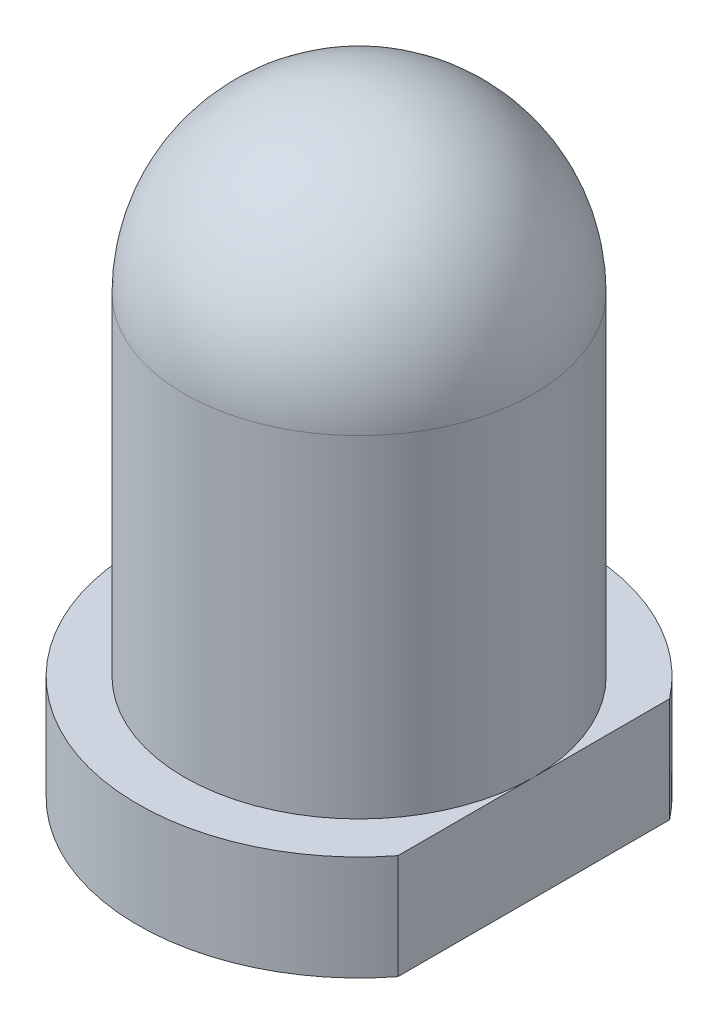
ISO-10303-21;
HEADER;
FILE_DESCRIPTION(('STEP AP214'),'2;1');
FILE_NAME('part.step','',(''),(''),'','','');
FILE_SCHEMA(('AUTOMOTIVE_DESIGN { 1 0 10303 214 1 1 1 1 }'));
ENDSEC;
DATA;
#1=APPLICATION_CONTEXT('core data for automotive mechanical design processes');
#2=APPLICATION_PROTOCOL_DEFINITION('international standard','automotive_design',2000,#1);
#3=PRODUCT_CONTEXT('',#1,'mechanical');
#4=PRODUCT('Part','Part','',(#3));
#5=PRODUCT_RELATED_PRODUCT_CATEGORY('part','',(#4));
#6=PRODUCT_DEFINITION_FORMATION('','',#4);
#7=PRODUCT_DEFINITION_CONTEXT('part definition',#1,'design');
#8=PRODUCT_DEFINITION('design','',#6,#7);
#9=PRODUCT_DEFINITION_SHAPE('','',#8);
#10=(LENGTH_UNIT() NAMED_UNIT(*) SI_UNIT(.MILLI.,.METRE.));
#11=(NAMED_UNIT(*) PLANE_ANGLE_UNIT() SI_UNIT($,.RADIAN.));
#12=(NAMED_UNIT(*) SI_UNIT($,.STERADIAN.) SOLID_ANGLE_UNIT());
#13=UNCERTAINTY_MEASURE_WITH_UNIT(LENGTH_MEASURE(1.E-05),#10,'distance_accuracy_value','');
#14=(GEOMETRIC_REPRESENTATION_CONTEXT(3) GLOBAL_UNCERTAINTY_ASSIGNED_CONTEXT((#13)) GLOBAL_UNIT_ASSIGNED_CONTEXT((#10,
#11,#12)) REPRESENTATION_CONTEXT('',''));
#15=CARTESIAN_POINT('',(0.,0.,0.));
#16=DIRECTION('',(0.,0.,1.));
#17=DIRECTION('',(1.,0.,0.));
#18=AXIS2_PLACEMENT_3D('',#15,#16,#17);
#19=CARTESIAN_POINT('',(0.,2.85,0.));
#20=DIRECTION('',(0.,-1.,0.));
#21=DIRECTION('',(1.,0.,0.));
#22=AXIS2_PLACEMENT_3D('',#19,#20,#21);
#23=SPHERICAL_SURFACE('',#22,1.5);
#24=CARTESIAN_POINT('',(0.,2.84999999999999,0.));
#25=DIRECTION('',(0.,-1.,0.));
#26=DIRECTION('',(1.,0.,0.));
#27=AXIS2_PLACEMENT_3D('',#24,#25,#26);
#28=CIRCLE('',#27,1.50000000000001);
#29=CARTESIAN_POINT('',(1.5,2.85,0.));
#30=VERTEX_POINT('',#29);
#31=EDGE_CURVE('E42',#30,#30,#28,.T.);
#32=ORIENTED_EDGE('',*,*,#31,.F.);
#33=EDGE_LOOP('',(#32));
#34=FACE_BOUND('',#33,.T.);
#35=ADVANCED_FACE('F35',(#34),#23,.T.);
#36=CARTESIAN_POINT('',(5.93600389952967E-13,-170.013908809735,0.));
#37=DIRECTION('',(0.,-1.,0.));
#38=DIRECTION('',(1.,0.,0.));
#39=AXIS2_PLACEMENT_3D('',#36,#37,#38);
#40=CYLINDRICAL_SURFACE('',#39,1.50000000000001);
#41=ORIENTED_EDGE('',*,*,#31,.T.);
#42=EDGE_LOOP('',(#41));
#43=FACE_BOUND('',#42,.T.);
#44=CARTESIAN_POINT('',(0.,0.,0.));
#45=DIRECTION('',(0.,-1.,0.));
#46=DIRECTION('',(1.,0.,0.));
#47=AXIS2_PLACEMENT_3D('',#44,#45,#46);
#48=CIRCLE('',#47,1.5);
#49=CARTESIAN_POINT('',(1.5,0.,0.));
#50=VERTEX_POINT('',#49);
#51=EDGE_CURVE('E11',#50,#50,#48,.T.);
#52=ORIENTED_EDGE('',*,*,#51,.F.);
#53=EDGE_LOOP('',(#52));
#54=FACE_BOUND('',#53,.T.);
#55=ADVANCED_FACE('F89',(#43,#54),#40,.T.);
#56=CARTESIAN_POINT('',(0.,0.,0.));
#57=DIRECTION('',(0.,-1.,0.));
#58=DIRECTION('',(1.,0.,0.));
#59=AXIS2_PLACEMENT_3D('',#56,#57,#58);
#60=PLANE('',#59);
#61=DIRECTION('',(0.,0.,1.));
#62=VECTOR('',#61,1.);
#63=CARTESIAN_POINT('',(1.5,0.,-1.16619037896906));
#64=LINE('',#63,#62);
#65=CARTESIAN_POINT('',(1.5,0.,1.16619037896906));
#66=VERTEX_POINT('',#65);
#67=EDGE_CURVE('E63',#50,#66,#64,.T.);
#68=ORIENTED_EDGE('',*,*,#67,.F.);
#69=ORIENTED_EDGE('',*,*,#51,.T.);
#70=CARTESIAN_POINT('',(1.5,0.,-1.16619037896906));
#71=VERTEX_POINT('',#70);
#72=EDGE_CURVE('E69',#71,#50,#64,.T.);
#73=ORIENTED_EDGE('',*,*,#72,.F.);
#74=CARTESIAN_POINT('',(0.,0.,0.));
#75=DIRECTION('',(0.,-1.,0.));
#76=DIRECTION('',(1.,0.,0.));
#77=AXIS2_PLACEMENT_3D('',#74,#75,#76);
#78=CIRCLE('',#77,1.9);
#79=EDGE_CURVE('E72',#66,#71,#78,.T.);
#80=ORIENTED_EDGE('',*,*,#79,.F.);
#81=EDGE_LOOP('',(#68,#69,#73,#80));
#82=FACE_BOUND('',#81,.T.);
#83=ADVANCED_FACE('F81',(#82),#60,.F.);
#84=CARTESIAN_POINT('',(0.,-0.9,0.));
#85=DIRECTION('',(0.,1.,0.));
#86=DIRECTION('',(-1.,0.,0.));
#87=AXIS2_PLACEMENT_3D('',#84,#85,#86);
#88=CYLINDRICAL_SURFACE('',#87,1.9);
#89=ORIENTED_EDGE('',*,*,#79,.T.);
#90=DIRECTION('',(0.,1.,0.));
#91=VECTOR('',#90,1.);
#92=CARTESIAN_POINT('',(1.5,-0.899999999999995,-1.16619037896906));
#93=LINE('',#92,#91);
#94=CARTESIAN_POINT('',(1.5,-0.899999999999995,-1.16619037896906));
#95=VERTEX_POINT('',#94);
#96=EDGE_CURVE('E79',#95,#71,#93,.T.);
#97=ORIENTED_EDGE('',*,*,#96,.F.);
#98=CARTESIAN_POINT('',(0.,-0.9,0.));
#99=DIRECTION('',(0.,-1.,0.));
#100=DIRECTION('',(1.,0.,0.));
#101=AXIS2_PLACEMENT_3D('',#98,#99,#100);
#102=CIRCLE('',#101,1.9);
#103=CARTESIAN_POINT('',(1.5,-0.899999999999995,1.16619037896906));
#104=VERTEX_POINT('',#103);
#105=EDGE_CURVE('E78',#104,#95,#102,.T.);
#106=ORIENTED_EDGE('',*,*,#105,.F.);
#107=DIRECTION('',(0.,1.,0.));
#108=VECTOR('',#107,1.);
#109=CARTESIAN_POINT('',(1.5,-0.899999999999995,1.16619037896906));
#110=LINE('',#109,#108);
#111=EDGE_CURVE('E66',#104,#66,#110,.T.);
#112=ORIENTED_EDGE('',*,*,#111,.T.);
#113=EDGE_LOOP('',(#89,#97,#106,#112));
#114=FACE_BOUND('',#113,.T.);
#115=ADVANCED_FACE('F76',(#114),#88,.T.);
#116=CARTESIAN_POINT('',(1.5,-0.899999999999995,-1.16619037896906));
#117=DIRECTION('',(-1.,0.,0.));
#118=DIRECTION('',(0.,-1.,0.));
#119=AXIS2_PLACEMENT_3D('',#116,#117,#118);
#120=PLANE('',#119);
#121=ORIENTED_EDGE('',*,*,#72,.T.);
#122=ORIENTED_EDGE('',*,*,#67,.T.);
#123=ORIENTED_EDGE('',*,*,#111,.F.);
#124=DIRECTION('',(0.,0.,1.));
#125=VECTOR('',#124,1.);
#126=CARTESIAN_POINT('',(1.5,-0.899999999999995,-1.16619037896906));
#127=LINE('',#126,#125);
#128=EDGE_CURVE('E52',#95,#104,#127,.T.);
#129=ORIENTED_EDGE('',*,*,#128,.F.);
#130=ORIENTED_EDGE('',*,*,#96,.T.);
#131=EDGE_LOOP('',(#121,#122,#123,#129,#130));
#132=FACE_BOUND('',#131,.T.);
#133=ADVANCED_FACE('F65',(#132),#120,.F.);
#134=CARTESIAN_POINT('',(0.,-0.9,0.));
#135=DIRECTION('',(0.,-1.,0.));
#136=DIRECTION('',(1.,0.,0.));
#137=AXIS2_PLACEMENT_3D('',#134,#135,#136);
#138=PLANE('',#137);
#139=ORIENTED_EDGE('',*,*,#105,.T.);
#140=ORIENTED_EDGE('',*,*,#128,.T.);
#141=EDGE_LOOP('',(#139,#140));
#142=FACE_BOUND('',#141,.T.);
#143=ADVANCED_FACE('F103',(#142),#138,.T.);
#144=CLOSED_SHELL('',(#35,#55,#83,#115,#133,#143));
#145=MANIFOLD_SOLID_BREP('B2',#144);
#146=ADVANCED_BREP_SHAPE_REPRESENTATION('',(#18,#145),#14);
#147=SHAPE_DEFINITION_REPRESENTATION(#9,#146);
ENDSEC;
END-ISO-10303-21;
